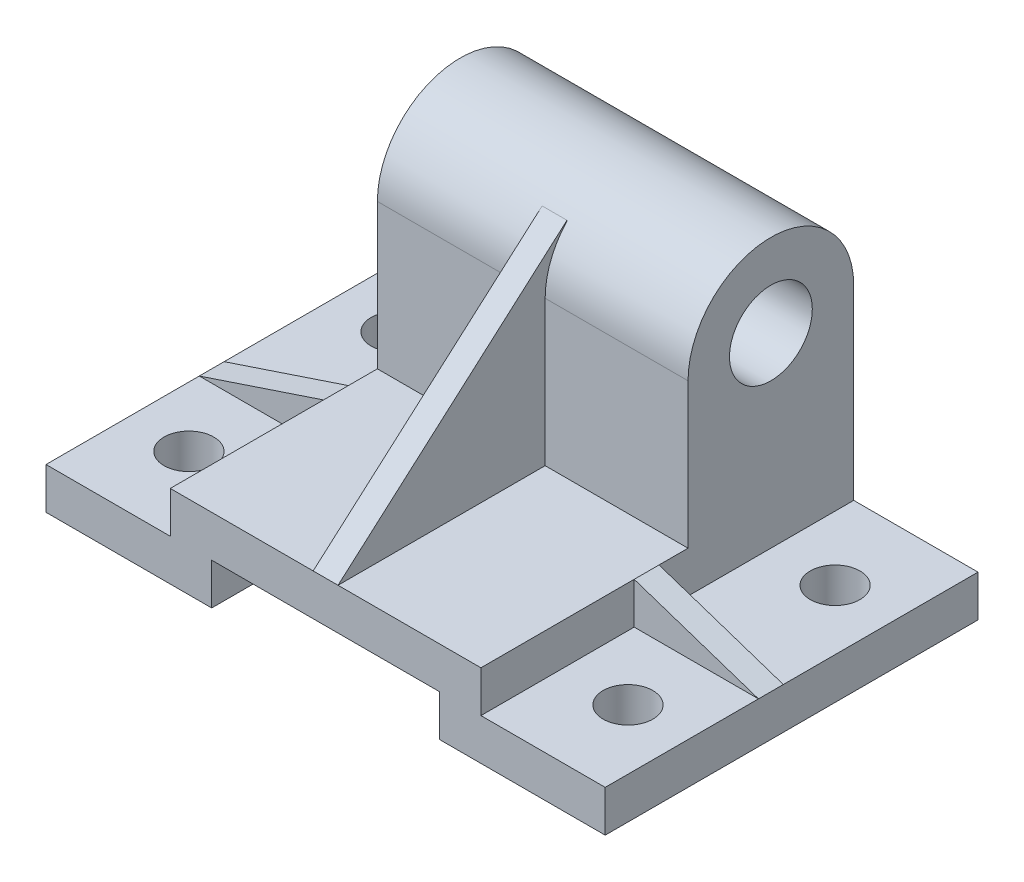
ISO-10303-21;
HEADER;
FILE_DESCRIPTION(('STEP AP214'),'2;1');
FILE_NAME('part.step','',(''),(''),'','','');
FILE_SCHEMA(('AUTOMOTIVE_DESIGN { 1 0 10303 214 1 1 1 1 }'));
ENDSEC;
DATA;
#1=APPLICATION_CONTEXT('core data for automotive mechanical design processes');
#2=APPLICATION_PROTOCOL_DEFINITION('international standard','automotive_design',2000,#1);
#3=PRODUCT_CONTEXT('',#1,'mechanical');
#4=PRODUCT('Part','Part','',(#3));
#5=PRODUCT_RELATED_PRODUCT_CATEGORY('part','',(#4));
#6=PRODUCT_DEFINITION_FORMATION('','',#4);
#7=PRODUCT_DEFINITION_CONTEXT('part definition',#1,'design');
#8=PRODUCT_DEFINITION('design','',#6,#7);
#9=PRODUCT_DEFINITION_SHAPE('','',#8);
#10=(LENGTH_UNIT() NAMED_UNIT(*) SI_UNIT(.MILLI.,.METRE.));
#11=(NAMED_UNIT(*) PLANE_ANGLE_UNIT() SI_UNIT($,.RADIAN.));
#12=(NAMED_UNIT(*) SI_UNIT($,.STERADIAN.) SOLID_ANGLE_UNIT());
#13=UNCERTAINTY_MEASURE_WITH_UNIT(LENGTH_MEASURE(1.E-05),#10,'distance_accuracy_value','');
#14=(GEOMETRIC_REPRESENTATION_CONTEXT(3) GLOBAL_UNCERTAINTY_ASSIGNED_CONTEXT((#13)) GLOBAL_UNIT_ASSIGNED_CONTEXT((#10,
#11,#12)) REPRESENTATION_CONTEXT('',''));
#15=CARTESIAN_POINT('',(0.,0.,0.));
#16=DIRECTION('',(0.,0.,1.));
#17=DIRECTION('',(1.,0.,0.));
#18=AXIS2_PLACEMENT_3D('',#15,#16,#17);
#19=CARTESIAN_POINT('',(0.,20.,0.));
#20=DIRECTION('',(0.,1.,0.));
#21=DIRECTION('',(0.,0.,1.));
#22=AXIS2_PLACEMENT_3D('',#19,#20,#21);
#23=PLANE('',#22);
#24=DIRECTION('',(1.,0.,0.));
#25=VECTOR('',#24,1.);
#26=CARTESIAN_POINT('',(-37.5,20.,45.));
#27=LINE('',#26,#25);
#28=CARTESIAN_POINT('',(-37.5,20.,45.));
#29=VERTEX_POINT('',#28);
#30=CARTESIAN_POINT('',(-3.,20.,45.));
#31=VERTEX_POINT('',#30);
#32=EDGE_CURVE('E400',#29,#31,#27,.T.);
#33=ORIENTED_EDGE('',*,*,#32,.T.);
#34=DIRECTION('',(0.,0.,1.));
#35=VECTOR('',#34,1.);
#36=CARTESIAN_POINT('',(-3.,20.,-5.00000000000001));
#37=LINE('',#36,#35);
#38=CARTESIAN_POINT('',(-3.,20.,-5.00000000000001));
#39=VERTEX_POINT('',#38);
#40=EDGE_CURVE('E246',#39,#31,#37,.T.);
#41=ORIENTED_EDGE('',*,*,#40,.F.);
#42=DIRECTION('',(-1.,0.,0.));
#43=VECTOR('',#42,1.);
#44=CARTESIAN_POINT('',(37.5,20.,-5.00000000000001));
#45=LINE('',#44,#43);
#46=CARTESIAN_POINT('',(-37.5,20.,-5.00000000000002));
#47=VERTEX_POINT('',#46);
#48=EDGE_CURVE('E290',#39,#47,#45,.T.);
#49=ORIENTED_EDGE('',*,*,#48,.T.);
#50=DIRECTION('',(0.,0.,1.));
#51=VECTOR('',#50,1.);
#52=CARTESIAN_POINT('',(-37.5,20.,-45.));
#53=LINE('',#52,#51);
#54=CARTESIAN_POINT('',(-37.5,20.,2.));
#55=VERTEX_POINT('',#54);
#56=EDGE_CURVE('E396',#47,#55,#53,.T.);
#57=ORIENTED_EDGE('',*,*,#56,.T.);
#58=DIRECTION('',(0.,0.,1.));
#59=VECTOR('',#58,1.);
#60=CARTESIAN_POINT('',(-37.5,20.,2.));
#61=LINE('',#60,#59);
#62=CARTESIAN_POINT('',(-37.5,20.,7.99999999999999));
#63=VERTEX_POINT('',#62);
#64=EDGE_CURVE('E321',#55,#63,#61,.T.);
#65=ORIENTED_EDGE('',*,*,#64,.T.);
#66=EDGE_CURVE('E394',#63,#29,#53,.T.);
#67=ORIENTED_EDGE('',*,*,#66,.T.);
#68=EDGE_LOOP('',(#33,#41,#49,#57,#65,#67));
#69=FACE_BOUND('',#68,.T.);
#70=ADVANCED_FACE('F47',(#69),#23,.T.);
#71=CARTESIAN_POINT('',(37.5,55.,-5.00000000000001));
#72=DIRECTION('',(0.,0.,-1.));
#73=DIRECTION('',(-1.,0.,0.));
#74=AXIS2_PLACEMENT_3D('',#71,#72,#73);
#75=PLANE('',#74);
#76=DIRECTION('',(0.,-1.,0.));
#77=VECTOR('',#76,1.);
#78=CARTESIAN_POINT('',(-3.,55.,-5.00000000000001));
#79=LINE('',#78,#77);
#80=CARTESIAN_POINT('',(-3.,55.,-5.00000000000001));
#81=VERTEX_POINT('',#80);
#82=EDGE_CURVE('E56',#81,#39,#79,.T.);
#83=ORIENTED_EDGE('',*,*,#82,.F.);
#84=DIRECTION('',(-1.,0.,0.));
#85=VECTOR('',#84,1.);
#86=CARTESIAN_POINT('',(37.5,55.,-5.00000000000001));
#87=LINE('',#86,#85);
#88=CARTESIAN_POINT('',(-37.5,55.,-5.00000000000001));
#89=VERTEX_POINT('',#88);
#90=EDGE_CURVE('E294',#81,#89,#87,.T.);
#91=ORIENTED_EDGE('',*,*,#90,.T.);
#92=DIRECTION('',(0.,-1.,0.));
#93=VECTOR('',#92,1.);
#94=CARTESIAN_POINT('',(-37.5,55.,-5.00000000000001));
#95=LINE('',#94,#93);
#96=EDGE_CURVE('E277',#89,#47,#95,.T.);
#97=ORIENTED_EDGE('',*,*,#96,.T.);
#98=ORIENTED_EDGE('',*,*,#48,.F.);
#99=EDGE_LOOP('',(#83,#91,#97,#98));
#100=FACE_BOUND('',#99,.T.);
#101=ADVANCED_FACE('F523',(#100),#75,.F.);
#102=DIRECTION('',(0.,0.,1.));
#103=VECTOR('',#102,1.);
#104=CARTESIAN_POINT('',(3.,20.,-5.00000000000001));
#105=LINE('',#104,#103);
#106=CARTESIAN_POINT('',(3.,20.,-5.00000000000001));
#107=VERTEX_POINT('',#106);
#108=CARTESIAN_POINT('',(3.,20.,45.));
#109=VERTEX_POINT('',#108);
#110=EDGE_CURVE('E63',#107,#109,#105,.T.);
#111=ORIENTED_EDGE('',*,*,#110,.T.);
#112=CARTESIAN_POINT('',(37.5,20.,45.));
#113=VERTEX_POINT('',#112);
#114=EDGE_CURVE('E399',#109,#113,#27,.T.);
#115=ORIENTED_EDGE('',*,*,#114,.T.);
#116=DIRECTION('',(0.,0.,-1.));
#117=VECTOR('',#116,1.);
#118=CARTESIAN_POINT('',(37.5,20.,-45.));
#119=LINE('',#118,#117);
#120=CARTESIAN_POINT('',(37.5,20.,8.));
#121=VERTEX_POINT('',#120);
#122=EDGE_CURVE('E390',#113,#121,#119,.T.);
#123=ORIENTED_EDGE('',*,*,#122,.T.);
#124=DIRECTION('',(0.,0.,1.));
#125=VECTOR('',#124,1.);
#126=CARTESIAN_POINT('',(37.5,20.,2.));
#127=LINE('',#126,#125);
#128=CARTESIAN_POINT('',(37.5,20.,1.99999999999999));
#129=VERTEX_POINT('',#128);
#130=EDGE_CURVE('E340',#129,#121,#127,.T.);
#131=ORIENTED_EDGE('',*,*,#130,.F.);
#132=CARTESIAN_POINT('',(37.5,20.,-5.00000000000001));
#133=VERTEX_POINT('',#132);
#134=EDGE_CURVE('E395',#129,#133,#119,.T.);
#135=ORIENTED_EDGE('',*,*,#134,.T.);
#136=EDGE_CURVE('E291',#133,#107,#45,.T.);
#137=ORIENTED_EDGE('',*,*,#136,.T.);
#138=EDGE_LOOP('',(#111,#115,#123,#131,#135,#137));
#139=FACE_BOUND('',#138,.T.);
#140=ADVANCED_FACE('F590',(#139),#23,.T.);
#141=CARTESIAN_POINT('',(0.,10.,0.));
#142=DIRECTION('',(0.,1.,0.));
#143=DIRECTION('',(0.,0.,1.));
#144=AXIS2_PLACEMENT_3D('',#141,#142,#143);
#145=PLANE('',#144);
#146=CARTESIAN_POINT('',(-53.,10.,-25.));
#147=DIRECTION('',(0.,1.,0.));
#148=DIRECTION('',(0.,0.,-1.));
#149=AXIS2_PLACEMENT_3D('',#146,#147,#148);
#150=CIRCLE('',#149,6.00000000000001);
#151=CARTESIAN_POINT('',(-53.,10.,-31.));
#152=VERTEX_POINT('',#151);
#153=EDGE_CURVE('E429',#152,#152,#150,.T.);
#154=ORIENTED_EDGE('',*,*,#153,.F.);
#155=EDGE_LOOP('',(#154));
#156=FACE_BOUND('',#155,.T.);
#157=DIRECTION('',(0.,0.,1.));
#158=VECTOR('',#157,1.);
#159=CARTESIAN_POINT('',(-67.5,10.,-45.));
#160=LINE('',#159,#158);
#161=CARTESIAN_POINT('',(-67.5,10.,-45.));
#162=VERTEX_POINT('',#161);
#163=CARTESIAN_POINT('',(-67.5,10.,2.));
#164=VERTEX_POINT('',#163);
#165=EDGE_CURVE('E472',#162,#164,#160,.T.);
#166=ORIENTED_EDGE('',*,*,#165,.T.);
#167=DIRECTION('',(-1.,0.,0.));
#168=VECTOR('',#167,1.);
#169=CARTESIAN_POINT('',(-37.5,10.,2.));
#170=LINE('',#169,#168);
#171=CARTESIAN_POINT('',(-37.5,10.,2.));
#172=VERTEX_POINT('',#171);
#173=EDGE_CURVE('E304',#172,#164,#170,.T.);
#174=ORIENTED_EDGE('',*,*,#173,.F.);
#175=DIRECTION('',(0.,0.,1.));
#176=VECTOR('',#175,1.);
#177=CARTESIAN_POINT('',(-37.5,10.,-45.));
#178=LINE('',#177,#176);
#179=CARTESIAN_POINT('',(-37.5,10.,-45.));
#180=VERTEX_POINT('',#179);
#181=EDGE_CURVE('E409',#180,#172,#178,.T.);
#182=ORIENTED_EDGE('',*,*,#181,.F.);
#183=DIRECTION('',(-1.,0.,0.));
#184=VECTOR('',#183,1.);
#185=CARTESIAN_POINT('',(-67.5,10.,-45.));
#186=LINE('',#185,#184);
#187=EDGE_CURVE('E465',#180,#162,#186,.T.);
#188=ORIENTED_EDGE('',*,*,#187,.T.);
#189=EDGE_LOOP('',(#166,#174,#182,#188));
#190=FACE_BOUND('',#189,.T.);
#191=ADVANCED_FACE('F542',(#156,#190),#145,.T.);
#192=CARTESIAN_POINT('',(-37.5,20.,-45.));
#193=DIRECTION('',(1.,0.,0.));
#194=DIRECTION('',(0.,0.,-1.));
#195=AXIS2_PLACEMENT_3D('',#192,#193,#194);
#196=PLANE('',#195);
#197=DIRECTION('',(0.,-1.,0.));
#198=VECTOR('',#197,1.);
#199=CARTESIAN_POINT('',(-37.5,20.,2.));
#200=LINE('',#199,#198);
#201=EDGE_CURVE('E308',#55,#172,#200,.T.);
#202=ORIENTED_EDGE('',*,*,#201,.F.);
#203=ORIENTED_EDGE('',*,*,#56,.F.);
#204=ORIENTED_EDGE('',*,*,#96,.F.);
#205=CARTESIAN_POINT('',(-37.5,55.,-25.));
#206=DIRECTION('',(1.,0.,0.));
#207=DIRECTION('',(0.,0.,-1.));
#208=AXIS2_PLACEMENT_3D('',#205,#206,#207);
#209=CIRCLE('',#208,20.);
#210=CARTESIAN_POINT('',(-37.5,55.,-45.));
#211=VERTEX_POINT('',#210);
#212=EDGE_CURVE('E268',#211,#89,#209,.T.);
#213=ORIENTED_EDGE('',*,*,#212,.F.);
#214=DIRECTION('',(0.,-1.,0.));
#215=VECTOR('',#214,1.);
#216=CARTESIAN_POINT('',(-37.5,20.,-45.));
#217=LINE('',#216,#215);
#218=EDGE_CURVE('E420',#211,#180,#217,.T.);
#219=ORIENTED_EDGE('',*,*,#218,.T.);
#220=ORIENTED_EDGE('',*,*,#181,.T.);
#221=EDGE_LOOP('',(#202,#203,#204,#213,#219,#220));
#222=FACE_BOUND('',#221,.T.);
#223=CARTESIAN_POINT('',(-37.5,55.,-25.));
#224=DIRECTION('',(1.,0.,0.));
#225=DIRECTION('',(0.,0.,-1.));
#226=AXIS2_PLACEMENT_3D('',#223,#224,#225);
#227=CIRCLE('',#226,10.);
#228=CARTESIAN_POINT('',(-37.5,55.,-35.));
#229=VERTEX_POINT('',#228);
#230=EDGE_CURVE('E263',#229,#229,#227,.T.);
#231=ORIENTED_EDGE('',*,*,#230,.T.);
#232=EDGE_LOOP('',(#231));
#233=FACE_BOUND('',#232,.T.);
#234=ADVANCED_FACE('F534',(#222,#233),#196,.F.);
#235=CARTESIAN_POINT('',(53.,10.,-25.));
#236=DIRECTION('',(0.,1.,0.));
#237=DIRECTION('',(0.,0.,1.));
#238=AXIS2_PLACEMENT_3D('',#235,#236,#237);
#239=CIRCLE('',#238,6.00000000000001);
#240=CARTESIAN_POINT('',(53.,10.,-19.));
#241=VERTEX_POINT('',#240);
#242=EDGE_CURVE('E437',#241,#241,#239,.T.);
#243=ORIENTED_EDGE('',*,*,#242,.F.);
#244=EDGE_LOOP('',(#243));
#245=FACE_BOUND('',#244,.T.);
#246=DIRECTION('',(0.,0.,-1.));
#247=VECTOR('',#246,1.);
#248=CARTESIAN_POINT('',(37.5,10.,-45.));
#249=LINE('',#248,#247);
#250=CARTESIAN_POINT('',(37.5,10.,2.));
#251=VERTEX_POINT('',#250);
#252=CARTESIAN_POINT('',(37.5,10.,-45.));
#253=VERTEX_POINT('',#252);
#254=EDGE_CURVE('E389',#251,#253,#249,.T.);
#255=ORIENTED_EDGE('',*,*,#254,.F.);
#256=DIRECTION('',(1.,0.,0.));
#257=VECTOR('',#256,1.);
#258=CARTESIAN_POINT('',(37.5,10.,2.));
#259=LINE('',#258,#257);
#260=CARTESIAN_POINT('',(67.5,10.,2.));
#261=VERTEX_POINT('',#260);
#262=EDGE_CURVE('E336',#251,#261,#259,.T.);
#263=ORIENTED_EDGE('',*,*,#262,.T.);
#264=DIRECTION('',(0.,0.,-1.));
#265=VECTOR('',#264,1.);
#266=CARTESIAN_POINT('',(67.5,10.,-45.));
#267=LINE('',#266,#265);
#268=CARTESIAN_POINT('',(67.5,10.,-45.));
#269=VERTEX_POINT('',#268);
#270=EDGE_CURVE('E466',#261,#269,#267,.T.);
#271=ORIENTED_EDGE('',*,*,#270,.T.);
#272=EDGE_CURVE('E467',#269,#253,#186,.T.);
#273=ORIENTED_EDGE('',*,*,#272,.T.);
#274=EDGE_LOOP('',(#255,#263,#271,#273));
#275=FACE_BOUND('',#274,.T.);
#276=ADVANCED_FACE('F578',(#245,#275),#145,.T.);
#277=CARTESIAN_POINT('',(37.5,20.,-45.));
#278=DIRECTION('',(-1.,0.,0.));
#279=DIRECTION('',(0.,0.,1.));
#280=AXIS2_PLACEMENT_3D('',#277,#278,#279);
#281=PLANE('',#280);
#282=DIRECTION('',(0.,-1.,0.));
#283=VECTOR('',#282,1.);
#284=CARTESIAN_POINT('',(37.5,20.,2.));
#285=LINE('',#284,#283);
#286=EDGE_CURVE('E331',#129,#251,#285,.T.);
#287=ORIENTED_EDGE('',*,*,#286,.T.);
#288=ORIENTED_EDGE('',*,*,#254,.T.);
#289=DIRECTION('',(0.,-1.,0.));
#290=VECTOR('',#289,1.);
#291=CARTESIAN_POINT('',(37.5,20.,-45.));
#292=LINE('',#291,#290);
#293=CARTESIAN_POINT('',(37.5,55.,-45.));
#294=VERTEX_POINT('',#293);
#295=EDGE_CURVE('E424',#294,#253,#292,.T.);
#296=ORIENTED_EDGE('',*,*,#295,.F.);
#297=CARTESIAN_POINT('',(37.5,55.,-25.));
#298=DIRECTION('',(1.,0.,0.));
#299=DIRECTION('',(0.,0.,-1.));
#300=AXIS2_PLACEMENT_3D('',#297,#298,#299);
#301=CIRCLE('',#300,20.);
#302=CARTESIAN_POINT('',(37.5,55.,-5.00000000000001));
#303=VERTEX_POINT('',#302);
#304=EDGE_CURVE('E272',#294,#303,#301,.T.);
#305=ORIENTED_EDGE('',*,*,#304,.T.);
#306=DIRECTION('',(0.,-1.,0.));
#307=VECTOR('',#306,1.);
#308=CARTESIAN_POINT('',(37.5,55.,-5.00000000000001));
#309=LINE('',#308,#307);
#310=EDGE_CURVE('E276',#303,#133,#309,.T.);
#311=ORIENTED_EDGE('',*,*,#310,.T.);
#312=ORIENTED_EDGE('',*,*,#134,.F.);
#313=EDGE_LOOP('',(#287,#288,#296,#305,#311,#312));
#314=FACE_BOUND('',#313,.T.);
#315=CARTESIAN_POINT('',(37.5,55.,-25.));
#316=DIRECTION('',(1.,0.,0.));
#317=DIRECTION('',(0.,0.,-1.));
#318=AXIS2_PLACEMENT_3D('',#315,#316,#317);
#319=CIRCLE('',#318,10.);
#320=CARTESIAN_POINT('',(37.5,55.,-35.));
#321=VERTEX_POINT('',#320);
#322=EDGE_CURVE('E264',#321,#321,#319,.T.);
#323=ORIENTED_EDGE('',*,*,#322,.F.);
#324=EDGE_LOOP('',(#323));
#325=FACE_BOUND('',#324,.T.);
#326=ADVANCED_FACE('F571',(#314,#325),#281,.F.);
#327=CARTESIAN_POINT('',(0.,0.,0.));
#328=DIRECTION('',(0.,1.,0.));
#329=DIRECTION('',(0.,0.,1.));
#330=AXIS2_PLACEMENT_3D('',#327,#328,#329);
#331=PLANE('',#330);
#332=CARTESIAN_POINT('',(53.,0.,-25.));
#333=DIRECTION('',(0.,1.,0.));
#334=DIRECTION('',(0.,0.,1.));
#335=AXIS2_PLACEMENT_3D('',#332,#333,#334);
#336=CIRCLE('',#335,6.00000000000001);
#337=CARTESIAN_POINT('',(53.,0.,-19.));
#338=VERTEX_POINT('',#337);
#339=EDGE_CURVE('E433',#338,#338,#336,.T.);
#340=ORIENTED_EDGE('',*,*,#339,.T.);
#341=EDGE_LOOP('',(#340));
#342=FACE_BOUND('',#341,.T.);
#343=CARTESIAN_POINT('',(53.,0.,25.));
#344=DIRECTION('',(0.,1.,0.));
#345=DIRECTION('',(0.,0.,-1.));
#346=AXIS2_PLACEMENT_3D('',#343,#344,#345);
#347=CIRCLE('',#346,6.00000000000001);
#348=CARTESIAN_POINT('',(53.,0.,19.));
#349=VERTEX_POINT('',#348);
#350=EDGE_CURVE('E441',#349,#349,#347,.T.);
#351=ORIENTED_EDGE('',*,*,#350,.T.);
#352=EDGE_LOOP('',(#351));
#353=FACE_BOUND('',#352,.T.);
#354=DIRECTION('',(1.,0.,0.));
#355=VECTOR('',#354,1.);
#356=CARTESIAN_POINT('',(-67.5,0.,45.));
#357=LINE('',#356,#355);
#358=CARTESIAN_POINT('',(27.5,0.,45.));
#359=VERTEX_POINT('',#358);
#360=CARTESIAN_POINT('',(67.5,0.,45.));
#361=VERTEX_POINT('',#360);
#362=EDGE_CURVE('E493',#359,#361,#357,.T.);
#363=ORIENTED_EDGE('',*,*,#362,.F.);
#364=DIRECTION('',(0.,0.,-1.));
#365=VECTOR('',#364,1.);
#366=CARTESIAN_POINT('',(27.5,0.,0.));
#367=LINE('',#366,#365);
#368=CARTESIAN_POINT('',(27.5,0.,-45.));
#369=VERTEX_POINT('',#368);
#370=EDGE_CURVE('E385',#359,#369,#367,.T.);
#371=ORIENTED_EDGE('',*,*,#370,.T.);
#372=DIRECTION('',(-1.,0.,0.));
#373=VECTOR('',#372,1.);
#374=CARTESIAN_POINT('',(-67.5,0.,-45.));
#375=LINE('',#374,#373);
#376=CARTESIAN_POINT('',(67.5,0.,-45.));
#377=VERTEX_POINT('',#376);
#378=EDGE_CURVE('E486',#377,#369,#375,.T.);
#379=ORIENTED_EDGE('',*,*,#378,.F.);
#380=DIRECTION('',(0.,0.,-1.));
#381=VECTOR('',#380,1.);
#382=CARTESIAN_POINT('',(67.5,0.,-45.));
#383=LINE('',#382,#381);
#384=EDGE_CURVE('E457',#361,#377,#383,.T.);
#385=ORIENTED_EDGE('',*,*,#384,.F.);
#386=EDGE_LOOP('',(#363,#371,#379,#385));
#387=FACE_BOUND('',#386,.T.);
#388=ADVANCED_FACE('F661',(#342,#353,#387),#331,.F.);
#389=DIRECTION('',(1.,0.,0.));
#390=VECTOR('',#389,1.);
#391=CARTESIAN_POINT('',(37.5,10.,8.));
#392=LINE('',#391,#390);
#393=CARTESIAN_POINT('',(37.5,10.,8.));
#394=VERTEX_POINT('',#393);
#395=CARTESIAN_POINT('',(67.5,10.,8.));
#396=VERTEX_POINT('',#395);
#397=EDGE_CURVE('E332',#394,#396,#392,.T.);
#398=ORIENTED_EDGE('',*,*,#397,.F.);
#399=CARTESIAN_POINT('',(37.5,10.,45.));
#400=VERTEX_POINT('',#399);
#401=EDGE_CURVE('E404',#400,#394,#249,.T.);
#402=ORIENTED_EDGE('',*,*,#401,.F.);
#403=DIRECTION('',(1.,0.,0.));
#404=VECTOR('',#403,1.);
#405=CARTESIAN_POINT('',(-67.5,10.,45.));
#406=LINE('',#405,#404);
#407=CARTESIAN_POINT('',(67.5,10.,45.));
#408=VERTEX_POINT('',#407);
#409=EDGE_CURVE('E476',#400,#408,#406,.T.);
#410=ORIENTED_EDGE('',*,*,#409,.T.);
#411=EDGE_CURVE('E461',#408,#396,#267,.T.);
#412=ORIENTED_EDGE('',*,*,#411,.T.);
#413=EDGE_LOOP('',(#398,#402,#410,#412));
#414=FACE_BOUND('',#413,.T.);
#415=CARTESIAN_POINT('',(53.,10.,25.));
#416=DIRECTION('',(0.,1.,0.));
#417=DIRECTION('',(0.,0.,-1.));
#418=AXIS2_PLACEMENT_3D('',#415,#416,#417);
#419=CIRCLE('',#418,6.00000000000001);
#420=CARTESIAN_POINT('',(53.,10.,19.));
#421=VERTEX_POINT('',#420);
#422=EDGE_CURVE('E445',#421,#421,#419,.T.);
#423=ORIENTED_EDGE('',*,*,#422,.F.);
#424=EDGE_LOOP('',(#423));
#425=FACE_BOUND('',#424,.T.);
#426=ADVANCED_FACE('F603',(#414,#425),#145,.T.);
#427=DIRECTION('',(-1.,0.,0.));
#428=VECTOR('',#427,1.);
#429=CARTESIAN_POINT('',(-37.5,10.,8.));
#430=LINE('',#429,#428);
#431=CARTESIAN_POINT('',(-37.5,10.,8.));
#432=VERTEX_POINT('',#431);
#433=CARTESIAN_POINT('',(-67.5,10.,8.));
#434=VERTEX_POINT('',#433);
#435=EDGE_CURVE('E314',#432,#434,#430,.T.);
#436=ORIENTED_EDGE('',*,*,#435,.T.);
#437=CARTESIAN_POINT('',(-67.5,10.,45.));
#438=VERTEX_POINT('',#437);
#439=EDGE_CURVE('E471',#434,#438,#160,.T.);
#440=ORIENTED_EDGE('',*,*,#439,.T.);
#441=CARTESIAN_POINT('',(-37.5,10.,45.));
#442=VERTEX_POINT('',#441);
#443=EDGE_CURVE('E477',#438,#442,#406,.T.);
#444=ORIENTED_EDGE('',*,*,#443,.T.);
#445=EDGE_CURVE('E408',#432,#442,#178,.T.);
#446=ORIENTED_EDGE('',*,*,#445,.F.);
#447=EDGE_LOOP('',(#436,#440,#444,#446));
#448=FACE_BOUND('',#447,.T.);
#449=CARTESIAN_POINT('',(-53.,10.,25.));
#450=DIRECTION('',(0.,1.,0.));
#451=DIRECTION('',(0.,0.,1.));
#452=AXIS2_PLACEMENT_3D('',#449,#450,#451);
#453=CIRCLE('',#452,6.00000000000001);
#454=CARTESIAN_POINT('',(-53.,10.,31.));
#455=VERTEX_POINT('',#454);
#456=EDGE_CURVE('E453',#455,#455,#453,.T.);
#457=ORIENTED_EDGE('',*,*,#456,.F.);
#458=EDGE_LOOP('',(#457));
#459=FACE_BOUND('',#458,.T.);
#460=ADVANCED_FACE('F561',(#448,#459),#145,.T.);
#461=CARTESIAN_POINT('',(-27.5,0.,-45.));
#462=VERTEX_POINT('',#461);
#463=CARTESIAN_POINT('',(-67.5,0.,-45.));
#464=VERTEX_POINT('',#463);
#465=EDGE_CURVE('E485',#462,#464,#375,.T.);
#466=ORIENTED_EDGE('',*,*,#465,.F.);
#467=DIRECTION('',(0.,0.,1.));
#468=VECTOR('',#467,1.);
#469=CARTESIAN_POINT('',(-27.5,0.,0.));
#470=LINE('',#469,#468);
#471=CARTESIAN_POINT('',(-27.5,0.,45.));
#472=VERTEX_POINT('',#471);
#473=EDGE_CURVE('E379',#462,#472,#470,.T.);
#474=ORIENTED_EDGE('',*,*,#473,.T.);
#475=CARTESIAN_POINT('',(-67.5,0.,45.));
#476=VERTEX_POINT('',#475);
#477=EDGE_CURVE('E494',#476,#472,#357,.T.);
#478=ORIENTED_EDGE('',*,*,#477,.F.);
#479=DIRECTION('',(0.,0.,1.));
#480=VECTOR('',#479,1.);
#481=CARTESIAN_POINT('',(-67.5,0.,-45.));
#482=LINE('',#481,#480);
#483=EDGE_CURVE('E490',#464,#476,#482,.T.);
#484=ORIENTED_EDGE('',*,*,#483,.F.);
#485=EDGE_LOOP('',(#466,#474,#478,#484));
#486=FACE_BOUND('',#485,.T.);
#487=CARTESIAN_POINT('',(-53.,0.,25.));
#488=DIRECTION('',(0.,1.,0.));
#489=DIRECTION('',(0.,0.,1.));
#490=AXIS2_PLACEMENT_3D('',#487,#488,#489);
#491=CIRCLE('',#490,6.00000000000001);
#492=CARTESIAN_POINT('',(-53.,0.,31.));
#493=VERTEX_POINT('',#492);
#494=EDGE_CURVE('E449',#493,#493,#491,.T.);
#495=ORIENTED_EDGE('',*,*,#494,.T.);
#496=EDGE_LOOP('',(#495));
#497=FACE_BOUND('',#496,.T.);
#498=CARTESIAN_POINT('',(-53.,0.,-25.));
#499=DIRECTION('',(0.,1.,0.));
#500=DIRECTION('',(0.,0.,-1.));
#501=AXIS2_PLACEMENT_3D('',#498,#499,#500);
#502=CIRCLE('',#501,6.00000000000001);
#503=CARTESIAN_POINT('',(-53.,0.,-31.));
#504=VERTEX_POINT('',#503);
#505=EDGE_CURVE('E428',#504,#504,#502,.T.);
#506=ORIENTED_EDGE('',*,*,#505,.T.);
#507=EDGE_LOOP('',(#506));
#508=FACE_BOUND('',#507,.T.);
#509=ADVANCED_FACE('F655',(#486,#497,#508),#331,.F.);
#510=CARTESIAN_POINT('',(67.5,10.,-45.));
#511=DIRECTION('',(-1.,0.,0.));
#512=DIRECTION('',(0.,0.,1.));
#513=AXIS2_PLACEMENT_3D('',#510,#511,#512);
#514=PLANE('',#513);
#515=ORIENTED_EDGE('',*,*,#384,.T.);
#516=DIRECTION('',(0.,-1.,0.));
#517=VECTOR('',#516,1.);
#518=CARTESIAN_POINT('',(67.5,10.,-45.));
#519=LINE('',#518,#517);
#520=EDGE_CURVE('E509',#269,#377,#519,.T.);
#521=ORIENTED_EDGE('',*,*,#520,.F.);
#522=ORIENTED_EDGE('',*,*,#270,.F.);
#523=DIRECTION('',(0.,0.,1.));
#524=VECTOR('',#523,1.);
#525=CARTESIAN_POINT('',(67.5,10.,2.));
#526=LINE('',#525,#524);
#527=EDGE_CURVE('E350',#261,#396,#526,.T.);
#528=ORIENTED_EDGE('',*,*,#527,.T.);
#529=ORIENTED_EDGE('',*,*,#411,.F.);
#530=DIRECTION('',(0.,-1.,0.));
#531=VECTOR('',#530,1.);
#532=CARTESIAN_POINT('',(67.5,10.,45.));
#533=LINE('',#532,#531);
#534=EDGE_CURVE('E481',#408,#361,#533,.T.);
#535=ORIENTED_EDGE('',*,*,#534,.T.);
#536=EDGE_LOOP('',(#515,#521,#522,#528,#529,#535));
#537=FACE_BOUND('',#536,.T.);
#538=ADVANCED_FACE('F49',(#537),#514,.F.);
#539=CARTESIAN_POINT('',(-67.5,10.,-45.));
#540=DIRECTION('',(0.,0.,1.));
#541=DIRECTION('',(1.,0.,0.));
#542=AXIS2_PLACEMENT_3D('',#539,#540,#541);
#543=PLANE('',#542);
#544=ORIENTED_EDGE('',*,*,#378,.T.);
#545=DIRECTION('',(0.,1.,0.));
#546=VECTOR('',#545,1.);
#547=CARTESIAN_POINT('',(27.5,-10.,-45.));
#548=LINE('',#547,#546);
#549=CARTESIAN_POINT('',(27.5,10.,-45.));
#550=VERTEX_POINT('',#549);
#551=EDGE_CURVE('E357',#369,#550,#548,.T.);
#552=ORIENTED_EDGE('',*,*,#551,.T.);
#553=DIRECTION('',(-1.,0.,0.));
#554=VECTOR('',#553,1.);
#555=CARTESIAN_POINT('',(-27.5,10.,-45.));
#556=LINE('',#555,#554);
#557=CARTESIAN_POINT('',(-27.5,10.,-45.));
#558=VERTEX_POINT('',#557);
#559=EDGE_CURVE('E361',#550,#558,#556,.T.);
#560=ORIENTED_EDGE('',*,*,#559,.T.);
#561=DIRECTION('',(0.,-1.,0.));
#562=VECTOR('',#561,1.);
#563=CARTESIAN_POINT('',(-27.5,-10.,-45.));
#564=LINE('',#563,#562);
#565=EDGE_CURVE('E366',#558,#462,#564,.T.);
#566=ORIENTED_EDGE('',*,*,#565,.T.);
#567=ORIENTED_EDGE('',*,*,#465,.T.);
#568=DIRECTION('',(0.,-1.,0.));
#569=VECTOR('',#568,1.);
#570=CARTESIAN_POINT('',(-67.5,10.,-45.));
#571=LINE('',#570,#569);
#572=EDGE_CURVE('E505',#162,#464,#571,.T.);
#573=ORIENTED_EDGE('',*,*,#572,.F.);
#574=ORIENTED_EDGE('',*,*,#187,.F.);
#575=ORIENTED_EDGE('',*,*,#218,.F.);
#576=DIRECTION('',(-1.,0.,0.));
#577=VECTOR('',#576,1.);
#578=CARTESIAN_POINT('',(37.5,55.,-45.));
#579=LINE('',#578,#577);
#580=EDGE_CURVE('E280',#294,#211,#579,.T.);
#581=ORIENTED_EDGE('',*,*,#580,.F.);
#582=ORIENTED_EDGE('',*,*,#295,.T.);
#583=ORIENTED_EDGE('',*,*,#272,.F.);
#584=ORIENTED_EDGE('',*,*,#520,.T.);
#585=EDGE_LOOP('',(#544,#552,#560,#566,#567,#573,#574,#575,#581,#582,#583,#584));
#586=FACE_BOUND('',#585,.T.);
#587=ADVANCED_FACE('F582',(#586),#543,.F.);
#588=CARTESIAN_POINT('',(-67.5,10.,-45.));
#589=DIRECTION('',(1.,0.,0.));
#590=DIRECTION('',(0.,0.,-1.));
#591=AXIS2_PLACEMENT_3D('',#588,#589,#590);
#592=PLANE('',#591);
#593=ORIENTED_EDGE('',*,*,#483,.T.);
#594=DIRECTION('',(0.,-1.,0.));
#595=VECTOR('',#594,1.);
#596=CARTESIAN_POINT('',(-67.5,10.,45.));
#597=LINE('',#596,#595);
#598=EDGE_CURVE('E501',#438,#476,#597,.T.);
#599=ORIENTED_EDGE('',*,*,#598,.F.);
#600=ORIENTED_EDGE('',*,*,#439,.F.);
#601=DIRECTION('',(0.,0.,1.));
#602=VECTOR('',#601,1.);
#603=CARTESIAN_POINT('',(-67.5,10.,2.));
#604=LINE('',#603,#602);
#605=EDGE_CURVE('E311',#164,#434,#604,.T.);
#606=ORIENTED_EDGE('',*,*,#605,.F.);
#607=ORIENTED_EDGE('',*,*,#165,.F.);
#608=ORIENTED_EDGE('',*,*,#572,.T.);
#609=EDGE_LOOP('',(#593,#599,#600,#606,#607,#608));
#610=FACE_BOUND('',#609,.T.);
#611=ADVANCED_FACE('F548',(#610),#592,.F.);
#612=CARTESIAN_POINT('',(-67.5,10.,45.));
#613=DIRECTION('',(0.,0.,-1.));
#614=DIRECTION('',(-1.,0.,0.));
#615=AXIS2_PLACEMENT_3D('',#612,#613,#614);
#616=PLANE('',#615);
#617=DIRECTION('',(-1.,0.,0.));
#618=VECTOR('',#617,1.);
#619=CARTESIAN_POINT('',(-27.5,10.,45.));
#620=LINE('',#619,#618);
#621=CARTESIAN_POINT('',(27.5,10.,45.));
#622=VERTEX_POINT('',#621);
#623=CARTESIAN_POINT('',(-27.5,10.,45.));
#624=VERTEX_POINT('',#623);
#625=EDGE_CURVE('E354',#622,#624,#620,.T.);
#626=ORIENTED_EDGE('',*,*,#625,.F.);
#627=DIRECTION('',(0.,-1.,0.));
#628=VECTOR('',#627,1.);
#629=CARTESIAN_POINT('',(27.5,10.,45.));
#630=LINE('',#629,#628);
#631=EDGE_CURVE('E513',#622,#359,#630,.T.);
#632=ORIENTED_EDGE('',*,*,#631,.T.);
#633=ORIENTED_EDGE('',*,*,#362,.T.);
#634=ORIENTED_EDGE('',*,*,#534,.F.);
#635=ORIENTED_EDGE('',*,*,#409,.F.);
#636=DIRECTION('',(0.,-1.,0.));
#637=VECTOR('',#636,1.);
#638=CARTESIAN_POINT('',(37.5,20.,45.));
#639=LINE('',#638,#637);
#640=EDGE_CURVE('E403',#113,#400,#639,.T.);
#641=ORIENTED_EDGE('',*,*,#640,.F.);
#642=ORIENTED_EDGE('',*,*,#114,.F.);
#643=DIRECTION('',(-1.,0.,0.));
#644=VECTOR('',#643,1.);
#645=CARTESIAN_POINT('',(3.,20.,45.));
#646=LINE('',#645,#644);
#647=EDGE_CURVE('E70',#109,#31,#646,.T.);
#648=ORIENTED_EDGE('',*,*,#647,.T.);
#649=ORIENTED_EDGE('',*,*,#32,.F.);
#650=DIRECTION('',(0.,-1.,0.));
#651=VECTOR('',#650,1.);
#652=CARTESIAN_POINT('',(-37.5,20.,45.));
#653=LINE('',#652,#651);
#654=EDGE_CURVE('E416',#29,#442,#653,.T.);
#655=ORIENTED_EDGE('',*,*,#654,.T.);
#656=ORIENTED_EDGE('',*,*,#443,.F.);
#657=ORIENTED_EDGE('',*,*,#598,.T.);
#658=ORIENTED_EDGE('',*,*,#477,.T.);
#659=DIRECTION('',(0.,-1.,0.));
#660=VECTOR('',#659,1.);
#661=CARTESIAN_POINT('',(-27.5,-10.,45.));
#662=LINE('',#661,#660);
#663=EDGE_CURVE('E362',#624,#472,#662,.T.);
#664=ORIENTED_EDGE('',*,*,#663,.F.);
#665=EDGE_LOOP('',(#626,#632,#633,#634,#635,#641,#642,#648,#649,#655,#656,#657,#658,#664));
#666=FACE_BOUND('',#665,.T.);
#667=ADVANCED_FACE('F608',(#666),#616,.F.);
#668=CARTESIAN_POINT('',(-53.,10.,25.));
#669=DIRECTION('',(0.,-1.,0.));
#670=DIRECTION('',(0.,0.,-1.));
#671=AXIS2_PLACEMENT_3D('',#668,#669,#670);
#672=CYLINDRICAL_SURFACE('',#671,6.00000000000001);
#673=ORIENTED_EDGE('',*,*,#456,.T.);
#674=EDGE_LOOP('',(#673));
#675=FACE_BOUND('',#674,.T.);
#676=ORIENTED_EDGE('',*,*,#494,.F.);
#677=EDGE_LOOP('',(#676));
#678=FACE_BOUND('',#677,.T.);
#679=ADVANCED_FACE('F677',(#675,#678),#672,.F.);
#680=CARTESIAN_POINT('',(53.,10.,25.));
#681=DIRECTION('',(0.,-1.,0.));
#682=DIRECTION('',(0.,0.,-1.));
#683=AXIS2_PLACEMENT_3D('',#680,#681,#682);
#684=CYLINDRICAL_SURFACE('',#683,6.00000000000001);
#685=ORIENTED_EDGE('',*,*,#422,.T.);
#686=EDGE_LOOP('',(#685));
#687=FACE_BOUND('',#686,.T.);
#688=ORIENTED_EDGE('',*,*,#350,.F.);
#689=EDGE_LOOP('',(#688));
#690=FACE_BOUND('',#689,.T.);
#691=ADVANCED_FACE('F861',(#687,#690),#684,.F.);
#692=CARTESIAN_POINT('',(53.,10.,-25.));
#693=DIRECTION('',(0.,-1.,0.));
#694=DIRECTION('',(0.,0.,-1.));
#695=AXIS2_PLACEMENT_3D('',#692,#693,#694);
#696=CYLINDRICAL_SURFACE('',#695,6.00000000000001);
#697=ORIENTED_EDGE('',*,*,#242,.T.);
#698=EDGE_LOOP('',(#697));
#699=FACE_BOUND('',#698,.T.);
#700=ORIENTED_EDGE('',*,*,#339,.F.);
#701=EDGE_LOOP('',(#700));
#702=FACE_BOUND('',#701,.T.);
#703=ADVANCED_FACE('F851',(#699,#702),#696,.F.);
#704=CARTESIAN_POINT('',(-53.,10.,-25.));
#705=DIRECTION('',(0.,-1.,0.));
#706=DIRECTION('',(0.,0.,-1.));
#707=AXIS2_PLACEMENT_3D('',#704,#705,#706);
#708=CYLINDRICAL_SURFACE('',#707,6.00000000000001);
#709=ORIENTED_EDGE('',*,*,#153,.T.);
#710=EDGE_LOOP('',(#709));
#711=FACE_BOUND('',#710,.T.);
#712=ORIENTED_EDGE('',*,*,#505,.F.);
#713=EDGE_LOOP('',(#712));
#714=FACE_BOUND('',#713,.T.);
#715=ADVANCED_FACE('F691',(#711,#714),#708,.F.);
#716=ORIENTED_EDGE('',*,*,#401,.T.);
#717=DIRECTION('',(0.,-1.,0.));
#718=VECTOR('',#717,1.);
#719=CARTESIAN_POINT('',(37.5,20.,8.));
#720=LINE('',#719,#718);
#721=EDGE_CURVE('E344',#121,#394,#720,.T.);
#722=ORIENTED_EDGE('',*,*,#721,.F.);
#723=ORIENTED_EDGE('',*,*,#122,.F.);
#724=ORIENTED_EDGE('',*,*,#640,.T.);
#725=EDGE_LOOP('',(#716,#722,#723,#724));
#726=FACE_BOUND('',#725,.T.);
#727=ADVANCED_FACE('F673',(#726),#281,.F.);
#728=ORIENTED_EDGE('',*,*,#66,.F.);
#729=DIRECTION('',(0.,-1.,0.));
#730=VECTOR('',#729,1.);
#731=CARTESIAN_POINT('',(-37.5,20.,8.));
#732=LINE('',#731,#730);
#733=EDGE_CURVE('E305',#63,#432,#732,.T.);
#734=ORIENTED_EDGE('',*,*,#733,.T.);
#735=ORIENTED_EDGE('',*,*,#445,.T.);
#736=ORIENTED_EDGE('',*,*,#654,.F.);
#737=EDGE_LOOP('',(#728,#734,#735,#736));
#738=FACE_BOUND('',#737,.T.);
#739=ADVANCED_FACE('F649',(#738),#196,.F.);
#740=CARTESIAN_POINT('',(27.5,-10.,-45.));
#741=DIRECTION('',(1.,0.,0.));
#742=DIRECTION('',(0.,0.,-1.));
#743=AXIS2_PLACEMENT_3D('',#740,#741,#742);
#744=PLANE('',#743);
#745=ORIENTED_EDGE('',*,*,#631,.F.);
#746=DIRECTION('',(0.,0.,1.));
#747=VECTOR('',#746,1.);
#748=CARTESIAN_POINT('',(27.5,10.,-45.));
#749=LINE('',#748,#747);
#750=EDGE_CURVE('E370',#550,#622,#749,.T.);
#751=ORIENTED_EDGE('',*,*,#750,.F.);
#752=ORIENTED_EDGE('',*,*,#551,.F.);
#753=ORIENTED_EDGE('',*,*,#370,.F.);
#754=EDGE_LOOP('',(#745,#751,#752,#753));
#755=FACE_BOUND('',#754,.T.);
#756=ADVANCED_FACE('F898',(#755),#744,.F.);
#757=CARTESIAN_POINT('',(-27.5,-10.,-45.));
#758=DIRECTION('',(-1.,0.,0.));
#759=DIRECTION('',(0.,0.,1.));
#760=AXIS2_PLACEMENT_3D('',#757,#758,#759);
#761=PLANE('',#760);
#762=ORIENTED_EDGE('',*,*,#565,.F.);
#763=DIRECTION('',(0.,0.,1.));
#764=VECTOR('',#763,1.);
#765=CARTESIAN_POINT('',(-27.5,10.,-45.));
#766=LINE('',#765,#764);
#767=EDGE_CURVE('E376',#558,#624,#766,.T.);
#768=ORIENTED_EDGE('',*,*,#767,.T.);
#769=ORIENTED_EDGE('',*,*,#663,.T.);
#770=ORIENTED_EDGE('',*,*,#473,.F.);
#771=EDGE_LOOP('',(#762,#768,#769,#770));
#772=FACE_BOUND('',#771,.T.);
#773=ADVANCED_FACE('F902',(#772),#761,.F.);
#774=CARTESIAN_POINT('',(-27.5,10.,-45.));
#775=DIRECTION('',(0.,1.,0.));
#776=DIRECTION('',(0.,0.,1.));
#777=AXIS2_PLACEMENT_3D('',#774,#775,#776);
#778=PLANE('',#777);
#779=ORIENTED_EDGE('',*,*,#625,.T.);
#780=ORIENTED_EDGE('',*,*,#767,.F.);
#781=ORIENTED_EDGE('',*,*,#559,.F.);
#782=ORIENTED_EDGE('',*,*,#750,.T.);
#783=EDGE_LOOP('',(#779,#780,#781,#782));
#784=FACE_BOUND('',#783,.T.);
#785=ADVANCED_FACE('F626',(#784),#778,.F.);
#786=CARTESIAN_POINT('',(67.5,10.,2.));
#787=DIRECTION('',(0.316227766016838,0.948683298050514,0.));
#788=DIRECTION('',(-0.948683298050514,0.316227766016838,0.));
#789=AXIS2_PLACEMENT_3D('',#786,#787,#788);
#790=PLANE('',#789);
#791=DIRECTION('',(-0.948683298050514,0.316227766016838,0.));
#792=VECTOR('',#791,1.);
#793=CARTESIAN_POINT('',(67.5,10.,8.));
#794=LINE('',#793,#792);
#795=EDGE_CURVE('E325',#396,#121,#794,.T.);
#796=ORIENTED_EDGE('',*,*,#795,.F.);
#797=ORIENTED_EDGE('',*,*,#527,.F.);
#798=DIRECTION('',(-0.948683298050514,0.316227766016838,0.));
#799=VECTOR('',#798,1.);
#800=CARTESIAN_POINT('',(67.5,10.,2.));
#801=LINE('',#800,#799);
#802=EDGE_CURVE('E328',#261,#129,#801,.T.);
#803=ORIENTED_EDGE('',*,*,#802,.T.);
#804=ORIENTED_EDGE('',*,*,#130,.T.);
#805=EDGE_LOOP('',(#796,#797,#803,#804));
#806=FACE_BOUND('',#805,.T.);
#807=ADVANCED_FACE('F614',(#806),#790,.T.);
#808=CARTESIAN_POINT('',(0.,0.,2.));
#809=DIRECTION('',(0.,0.,1.));
#810=DIRECTION('',(1.,0.,0.));
#811=AXIS2_PLACEMENT_3D('',#808,#809,#810);
#812=PLANE('',#811);
#813=ORIENTED_EDGE('',*,*,#802,.F.);
#814=ORIENTED_EDGE('',*,*,#262,.F.);
#815=ORIENTED_EDGE('',*,*,#286,.F.);
#816=EDGE_LOOP('',(#813,#814,#815));
#817=FACE_BOUND('',#816,.T.);
#818=ADVANCED_FACE('F616',(#817),#812,.F.);
#819=CARTESIAN_POINT('',(0.,0.,8.));
#820=DIRECTION('',(0.,0.,1.));
#821=DIRECTION('',(1.,0.,0.));
#822=AXIS2_PLACEMENT_3D('',#819,#820,#821);
#823=PLANE('',#822);
#824=ORIENTED_EDGE('',*,*,#795,.T.);
#825=ORIENTED_EDGE('',*,*,#721,.T.);
#826=ORIENTED_EDGE('',*,*,#397,.T.);
#827=EDGE_LOOP('',(#824,#825,#826));
#828=FACE_BOUND('',#827,.T.);
#829=ADVANCED_FACE('F618',(#828),#823,.T.);
#830=CARTESIAN_POINT('',(-67.5,10.,2.));
#831=DIRECTION('',(0.316227766016838,-0.948683298050514,0.));
#832=DIRECTION('',(0.948683298050514,0.316227766016838,0.));
#833=AXIS2_PLACEMENT_3D('',#830,#831,#832);
#834=PLANE('',#833);
#835=DIRECTION('',(0.948683298050514,0.316227766016838,0.));
#836=VECTOR('',#835,1.);
#837=CARTESIAN_POINT('',(-67.5,10.,8.));
#838=LINE('',#837,#836);
#839=EDGE_CURVE('E299',#434,#63,#838,.T.);
#840=ORIENTED_EDGE('',*,*,#839,.T.);
#841=ORIENTED_EDGE('',*,*,#64,.F.);
#842=DIRECTION('',(0.948683298050514,0.316227766016838,0.));
#843=VECTOR('',#842,1.);
#844=CARTESIAN_POINT('',(-67.5,10.,2.));
#845=LINE('',#844,#843);
#846=EDGE_CURVE('E300',#164,#55,#845,.T.);
#847=ORIENTED_EDGE('',*,*,#846,.F.);
#848=ORIENTED_EDGE('',*,*,#605,.T.);
#849=EDGE_LOOP('',(#840,#841,#847,#848));
#850=FACE_BOUND('',#849,.T.);
#851=ADVANCED_FACE('F554',(#850),#834,.F.);
#852=CARTESIAN_POINT('',(0.,0.,2.));
#853=DIRECTION('',(0.,0.,1.));
#854=DIRECTION('',(-1.,0.,0.));
#855=AXIS2_PLACEMENT_3D('',#852,#853,#854);
#856=PLANE('',#855);
#857=ORIENTED_EDGE('',*,*,#846,.T.);
#858=ORIENTED_EDGE('',*,*,#201,.T.);
#859=ORIENTED_EDGE('',*,*,#173,.T.);
#860=EDGE_LOOP('',(#857,#858,#859));
#861=FACE_BOUND('',#860,.T.);
#862=ADVANCED_FACE('F538',(#861),#856,.F.);
#863=CARTESIAN_POINT('',(0.,0.,8.));
#864=DIRECTION('',(0.,0.,1.));
#865=DIRECTION('',(-1.,0.,0.));
#866=AXIS2_PLACEMENT_3D('',#863,#864,#865);
#867=PLANE('',#866);
#868=ORIENTED_EDGE('',*,*,#839,.F.);
#869=ORIENTED_EDGE('',*,*,#435,.F.);
#870=ORIENTED_EDGE('',*,*,#733,.F.);
#871=EDGE_LOOP('',(#868,#869,#870));
#872=FACE_BOUND('',#871,.T.);
#873=ADVANCED_FACE('F557',(#872),#867,.T.);
#874=CARTESIAN_POINT('',(37.5,55.,-25.));
#875=DIRECTION('',(-1.,0.,0.));
#876=DIRECTION('',(0.,0.,1.));
#877=AXIS2_PLACEMENT_3D('',#874,#875,#876);
#878=CYLINDRICAL_SURFACE('',#877,20.);
#879=DIRECTION('',(-1.,0.,0.));
#880=VECTOR('',#879,1.);
#881=CARTESIAN_POINT('',(37.5,68.5102915195619,-10.253067333969));
#882=LINE('',#881,#880);
#883=CARTESIAN_POINT('',(-3.,68.5102915195619,-10.253067333969));
#884=VERTEX_POINT('',#883);
#885=CARTESIAN_POINT('',(3.,68.5102915195619,-10.253067333969));
#886=VERTEX_POINT('',#885);
#887=EDGE_CURVE('E260',#884,#886,#882,.F.);
#888=ORIENTED_EDGE('',*,*,#887,.T.);
#889=CARTESIAN_POINT('',(3.,55.,-25.));
#890=DIRECTION('',(1.,0.,0.));
#891=DIRECTION('',(0.,0.,-1.));
#892=AXIS2_PLACEMENT_3D('',#889,#890,#891);
#893=CIRCLE('',#892,20.);
#894=CARTESIAN_POINT('',(3.,55.,-5.00000000000001));
#895=VERTEX_POINT('',#894);
#896=EDGE_CURVE('E239',#886,#895,#893,.T.);
#897=ORIENTED_EDGE('',*,*,#896,.T.);
#898=EDGE_CURVE('E295',#303,#895,#87,.T.);
#899=ORIENTED_EDGE('',*,*,#898,.F.);
#900=ORIENTED_EDGE('',*,*,#304,.F.);
#901=ORIENTED_EDGE('',*,*,#580,.T.);
#902=ORIENTED_EDGE('',*,*,#212,.T.);
#903=ORIENTED_EDGE('',*,*,#90,.F.);
#904=CARTESIAN_POINT('',(-3.,55.,-25.));
#905=DIRECTION('',(1.,0.,0.));
#906=DIRECTION('',(0.,0.,-1.));
#907=AXIS2_PLACEMENT_3D('',#904,#905,#906);
#908=CIRCLE('',#907,20.);
#909=EDGE_CURVE('E228',#884,#81,#908,.T.);
#910=ORIENTED_EDGE('',*,*,#909,.F.);
#911=EDGE_LOOP('',(#888,#897,#899,#900,#901,#902,#903,#910));
#912=FACE_BOUND('',#911,.T.);
#913=ADVANCED_FACE('F526',(#912),#878,.T.);
#914=ORIENTED_EDGE('',*,*,#898,.T.);
#915=DIRECTION('',(0.,-1.,0.));
#916=VECTOR('',#915,1.);
#917=CARTESIAN_POINT('',(3.,55.,-5.00000000000001));
#918=LINE('',#917,#916);
#919=EDGE_CURVE('E11',#895,#107,#918,.T.);
#920=ORIENTED_EDGE('',*,*,#919,.T.);
#921=ORIENTED_EDGE('',*,*,#136,.F.);
#922=ORIENTED_EDGE('',*,*,#310,.F.);
#923=EDGE_LOOP('',(#914,#920,#921,#922));
#924=FACE_BOUND('',#923,.T.);
#925=ADVANCED_FACE('F589',(#924),#75,.F.);
#926=CARTESIAN_POINT('',(37.5,55.,-25.));
#927=DIRECTION('',(-1.,0.,0.));
#928=DIRECTION('',(0.,0.,1.));
#929=AXIS2_PLACEMENT_3D('',#926,#927,#928);
#930=CYLINDRICAL_SURFACE('',#929,10.);
#931=ORIENTED_EDGE('',*,*,#322,.T.);
#932=EDGE_LOOP('',(#931));
#933=FACE_BOUND('',#932,.T.);
#934=ORIENTED_EDGE('',*,*,#230,.F.);
#935=EDGE_LOOP('',(#934));
#936=FACE_BOUND('',#935,.T.);
#937=ADVANCED_FACE('F772',(#933,#936),#930,.F.);
#938=CARTESIAN_POINT('',(3.,68.6789959050149,-10.2713359418986));
#939=DIRECTION('',(0.,-0.107658315368079,-0.994187953624518));
#940=DIRECTION('',(0.,0.994187953624518,-0.107658315368079));
#941=AXIS2_PLACEMENT_3D('',#938,#939,#940);
#942=PLANE('',#941);
#943=ORIENTED_EDGE('',*,*,#887,.F.);
#944=DIRECTION('',(0.,-0.994187953624518,0.107658315368079));
#945=VECTOR('',#944,1.);
#946=CARTESIAN_POINT('',(-3.,68.6789959050149,-10.2713359418986));
#947=LINE('',#946,#945);
#948=CARTESIAN_POINT('',(-3.,68.6789959050149,-10.2713359418986));
#949=VERTEX_POINT('',#948);
#950=EDGE_CURVE('E223',#949,#884,#947,.T.);
#951=ORIENTED_EDGE('',*,*,#950,.F.);
#952=DIRECTION('',(-1.,0.,0.));
#953=VECTOR('',#952,1.);
#954=CARTESIAN_POINT('',(3.,68.6789959050149,-10.2713359418986));
#955=LINE('',#954,#953);
#956=CARTESIAN_POINT('',(3.,68.6789959050149,-10.2713359418986));
#957=VERTEX_POINT('',#956);
#958=EDGE_CURVE('E216',#957,#949,#955,.T.);
#959=ORIENTED_EDGE('',*,*,#958,.F.);
#960=DIRECTION('',(0.,-0.994187953624518,0.107658315368079));
#961=VECTOR('',#960,1.);
#962=CARTESIAN_POINT('',(3.,68.6789959050149,-10.2713359418986));
#963=LINE('',#962,#961);
#964=EDGE_CURVE('E221',#957,#886,#963,.T.);
#965=ORIENTED_EDGE('',*,*,#964,.T.);
#966=EDGE_LOOP('',(#943,#951,#959,#965));
#967=FACE_BOUND('',#966,.T.);
#968=ADVANCED_FACE('F219',(#967),#942,.T.);
#969=CARTESIAN_POINT('',(3.,0.,0.));
#970=DIRECTION('',(1.,0.,0.));
#971=DIRECTION('',(0.,0.,-1.));
#972=AXIS2_PLACEMENT_3D('',#969,#970,#971);
#973=PLANE('',#972);
#974=ORIENTED_EDGE('',*,*,#896,.F.);
#975=ORIENTED_EDGE('',*,*,#964,.F.);
#976=DIRECTION('',(0.,0.660935598583473,-0.750442625738375));
#977=VECTOR('',#976,1.);
#978=CARTESIAN_POINT('',(3.,20.,45.));
#979=LINE('',#978,#977);
#980=EDGE_CURVE('E231',#109,#957,#979,.T.);
#981=ORIENTED_EDGE('',*,*,#980,.F.);
#982=ORIENTED_EDGE('',*,*,#110,.F.);
#983=ORIENTED_EDGE('',*,*,#919,.F.);
#984=EDGE_LOOP('',(#974,#975,#981,#982,#983));
#985=FACE_BOUND('',#984,.T.);
#986=ADVANCED_FACE('F237',(#985),#973,.T.);
#987=CARTESIAN_POINT('',(-3.,0.,0.));
#988=DIRECTION('',(1.,0.,0.));
#989=DIRECTION('',(0.,0.,-1.));
#990=AXIS2_PLACEMENT_3D('',#987,#988,#989);
#991=PLANE('',#990);
#992=ORIENTED_EDGE('',*,*,#950,.T.);
#993=ORIENTED_EDGE('',*,*,#909,.T.);
#994=ORIENTED_EDGE('',*,*,#82,.T.);
#995=ORIENTED_EDGE('',*,*,#40,.T.);
#996=DIRECTION('',(0.,0.660935598583473,-0.750442625738375));
#997=VECTOR('',#996,1.);
#998=CARTESIAN_POINT('',(-3.,20.,45.));
#999=LINE('',#998,#997);
#1000=EDGE_CURVE('E250',#31,#949,#999,.T.);
#1001=ORIENTED_EDGE('',*,*,#1000,.T.);
#1002=EDGE_LOOP('',(#992,#993,#994,#995,#1001));
#1003=FACE_BOUND('',#1002,.T.);
#1004=ADVANCED_FACE('F519',(#1003),#991,.F.);
#1005=CARTESIAN_POINT('',(3.,20.,45.));
#1006=DIRECTION('',(0.,0.750442625738375,0.660935598583473));
#1007=DIRECTION('',(0.,-0.660935598583473,0.750442625738375));
#1008=AXIS2_PLACEMENT_3D('',#1005,#1006,#1007);
#1009=PLANE('',#1008);
#1010=ORIENTED_EDGE('',*,*,#1000,.F.);
#1011=ORIENTED_EDGE('',*,*,#647,.F.);
#1012=ORIENTED_EDGE('',*,*,#980,.T.);
#1013=ORIENTED_EDGE('',*,*,#958,.T.);
#1014=EDGE_LOOP('',(#1010,#1011,#1012,#1013));
#1015=FACE_BOUND('',#1014,.T.);
#1016=ADVANCED_FACE('F232',(#1015),#1009,.T.);
#1017=CLOSED_SHELL('',(#70,#101,#140,#191,#234,#276,#326,#388,#426,#460,#509,#538,#587,#611,
#667,#679,#691,#703,#715,#727,#739,#756,#773,#785,#807,#818,#829,#851,#862,#873,#913,#925,#937,
#968,#986,#1004,#1016));
#1018=MANIFOLD_SOLID_BREP('B2',#1017);
#1019=ADVANCED_BREP_SHAPE_REPRESENTATION('',(#18,#1018),#14);
#1020=SHAPE_DEFINITION_REPRESENTATION(#9,#1019);
ENDSEC;
END-ISO-10303-21;
